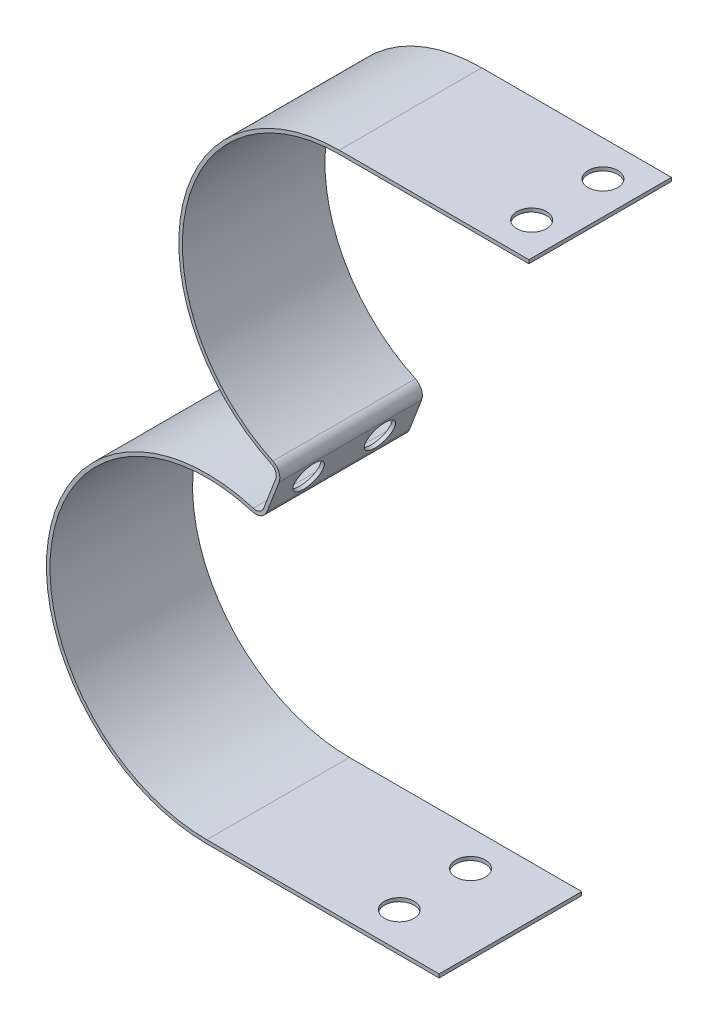
ISO-10303-21;
HEADER;
FILE_DESCRIPTION(('STEP AP214'),'2;1');
FILE_NAME('part.step','',(''),(''),'','','');
FILE_SCHEMA(('AUTOMOTIVE_DESIGN { 1 0 10303 214 1 1 1 1 }'));
ENDSEC;
DATA;
#1=APPLICATION_CONTEXT('core data for automotive mechanical design processes');
#2=APPLICATION_PROTOCOL_DEFINITION('international standard','automotive_design',2000,#1);
#3=PRODUCT_CONTEXT('',#1,'mechanical');
#4=PRODUCT('Part','Part','',(#3));
#5=PRODUCT_RELATED_PRODUCT_CATEGORY('part','',(#4));
#6=PRODUCT_DEFINITION_FORMATION('','',#4);
#7=PRODUCT_DEFINITION_CONTEXT('part definition',#1,'design');
#8=PRODUCT_DEFINITION('design','',#6,#7);
#9=PRODUCT_DEFINITION_SHAPE('','',#8);
#10=(LENGTH_UNIT() NAMED_UNIT(*) SI_UNIT(.MILLI.,.METRE.));
#11=(NAMED_UNIT(*) PLANE_ANGLE_UNIT() SI_UNIT($,.RADIAN.));
#12=(NAMED_UNIT(*) SI_UNIT($,.STERADIAN.) SOLID_ANGLE_UNIT());
#13=UNCERTAINTY_MEASURE_WITH_UNIT(LENGTH_MEASURE(1.E-05),#10,'distance_accuracy_value','');
#14=(GEOMETRIC_REPRESENTATION_CONTEXT(3) GLOBAL_UNCERTAINTY_ASSIGNED_CONTEXT((#13)) GLOBAL_UNIT_ASSIGNED_CONTEXT((#10,
#11,#12)) REPRESENTATION_CONTEXT('',''));
#15=CARTESIAN_POINT('',(0.,0.,0.));
#16=DIRECTION('',(0.,0.,1.));
#17=DIRECTION('',(1.,0.,0.));
#18=AXIS2_PLACEMENT_3D('',#15,#16,#17);
#19=CARTESIAN_POINT('',(0.,0.,31.75));
#20=DIRECTION('',(0.,0.,-1.));
#21=DIRECTION('',(-1.,0.,0.));
#22=AXIS2_PLACEMENT_3D('',#19,#20,#21);
#23=CYLINDRICAL_SURFACE('',#22,35.71875);
#24=CARTESIAN_POINT('',(0.,0.,0.));
#25=DIRECTION('',(0.,0.,1.));
#26=DIRECTION('',(1.,0.,0.));
#27=AXIS2_PLACEMENT_3D('',#24,#25,#26);
#28=CIRCLE('',#27,35.71875);
#29=CARTESIAN_POINT('',(0.,35.71875,0.));
#30=VERTEX_POINT('',#29);
#31=CARTESIAN_POINT('',(-15.1176216798867,-32.3618079888365,0.));
#32=VERTEX_POINT('',#31);
#33=EDGE_CURVE('E247',#30,#32,#28,.T.);
#34=ORIENTED_EDGE('',*,*,#33,.T.);
#35=DIRECTION('',(0.,0.,-1.));
#36=VECTOR('',#35,1.);
#37=CARTESIAN_POINT('',(-15.1176216798867,-32.3618079888365,31.75));
#38=LINE('',#37,#36);
#39=CARTESIAN_POINT('',(-15.1176216798867,-32.3618079888365,31.75));
#40=VERTEX_POINT('',#39);
#41=EDGE_CURVE('E339',#32,#40,#38,.F.);
#42=ORIENTED_EDGE('',*,*,#41,.T.);
#43=CARTESIAN_POINT('',(0.,0.,31.75));
#44=DIRECTION('',(0.,0.,1.));
#45=DIRECTION('',(1.,0.,0.));
#46=AXIS2_PLACEMENT_3D('',#43,#44,#45);
#47=CIRCLE('',#46,35.71875);
#48=CARTESIAN_POINT('',(0.,35.71875,31.75));
#49=VERTEX_POINT('',#48);
#50=EDGE_CURVE('E285',#49,#40,#47,.T.);
#51=ORIENTED_EDGE('',*,*,#50,.F.);
#52=DIRECTION('',(0.,0.,-1.));
#53=VECTOR('',#52,1.);
#54=CARTESIAN_POINT('',(0.,35.71875,31.75));
#55=LINE('',#54,#53);
#56=EDGE_CURVE('E246',#49,#30,#55,.T.);
#57=ORIENTED_EDGE('',*,*,#56,.T.);
#58=EDGE_LOOP('',(#34,#42,#51,#57));
#59=FACE_BOUND('',#58,.T.);
#60=ADVANCED_FACE('F41',(#59),#23,.T.);
#61=CARTESIAN_POINT('',(-17.4708747755268,-43.4671229922889,31.75));
#62=DIRECTION('',(0.934042574676225,-0.357161684244276,0.));
#63=DIRECTION('',(0.357161684244276,0.934042574676226,0.));
#64=AXIS2_PLACEMENT_3D('',#61,#62,#63);
#65=PLANE('',#64);
#66=CARTESIAN_POINT('',(-15.4832448108318,-38.2691101828923,23.8125));
#67=DIRECTION('',(-0.934042574676225,0.357161684244276,0.));
#68=DIRECTION('',(-0.357161684244276,-0.934042574676225,0.));
#69=AXIS2_PLACEMENT_3D('',#66,#67,#68);
#70=CIRCLE('',#69,3.302);
#71=CARTESIAN_POINT('',(-16.6625926922064,-41.3533187644732,23.8125));
#72=VERTEX_POINT('',#71);
#73=EDGE_CURVE('E318',#72,#72,#70,.T.);
#74=ORIENTED_EDGE('',*,*,#73,.F.);
#75=EDGE_LOOP('',(#74));
#76=FACE_BOUND('',#75,.T.);
#77=CARTESIAN_POINT('',(-15.4832448108318,-38.2691101828923,7.9375));
#78=DIRECTION('',(-0.934042574676225,0.357161684244276,0.));
#79=DIRECTION('',(-0.357161684244276,-0.934042574676225,0.));
#80=AXIS2_PLACEMENT_3D('',#77,#78,#79);
#81=CIRCLE('',#80,3.302);
#82=CARTESIAN_POINT('',(-16.6625926922064,-41.3533187644732,7.9375));
#83=VERTEX_POINT('',#82);
#84=EDGE_CURVE('E313',#83,#83,#81,.T.);
#85=ORIENTED_EDGE('',*,*,#84,.F.);
#86=EDGE_LOOP('',(#85));
#87=FACE_BOUND('',#86,.T.);
#88=DIRECTION('',(-0.357161684244276,-0.934042574676225,0.));
#89=VECTOR('',#88,1.);
#90=CARTESIAN_POINT('',(-17.4708747755268,-43.4671229922889,0.));
#91=LINE('',#90,#89);
#92=CARTESIAN_POINT('',(-14.1445437313891,-34.7681640900598,0.));
#93=VERTEX_POINT('',#92);
#94=CARTESIAN_POINT('',(-16.8219458902744,-41.7700562757248,0.));
#95=VERTEX_POINT('',#94);
#96=EDGE_CURVE('E251',#93,#95,#91,.T.);
#97=ORIENTED_EDGE('',*,*,#96,.T.);
#98=DIRECTION('',(0.,0.,1.));
#99=VECTOR('',#98,1.);
#100=CARTESIAN_POINT('',(-16.8219458902744,-41.7700562757248,31.75));
#101=LINE('',#100,#99);
#102=CARTESIAN_POINT('',(-16.8219458902744,-41.7700562757248,31.75));
#103=VERTEX_POINT('',#102);
#104=EDGE_CURVE('E336',#95,#103,#101,.T.);
#105=ORIENTED_EDGE('',*,*,#104,.T.);
#106=DIRECTION('',(-0.357161684244276,-0.934042574676225,0.));
#107=VECTOR('',#106,1.);
#108=CARTESIAN_POINT('',(-17.4708747755268,-43.4671229922889,31.75));
#109=LINE('',#108,#107);
#110=CARTESIAN_POINT('',(-14.1445437313891,-34.7681640900598,31.75));
#111=VERTEX_POINT('',#110);
#112=EDGE_CURVE('E201',#111,#103,#109,.T.);
#113=ORIENTED_EDGE('',*,*,#112,.F.);
#114=DIRECTION('',(0.,0.,1.));
#115=VECTOR('',#114,1.);
#116=CARTESIAN_POINT('',(-14.1445437313891,-34.7681640900598,0.));
#117=LINE('',#116,#115);
#118=EDGE_CURVE('E332',#111,#93,#117,.F.);
#119=ORIENTED_EDGE('',*,*,#118,.T.);
#120=EDGE_LOOP('',(#97,#105,#113,#119));
#121=FACE_BOUND('',#120,.T.);
#122=ADVANCED_FACE('F412',(#76,#87,#121),#65,.F.);
#123=CARTESIAN_POINT('',(-29.483697034365,-77.1052145395224,31.75));
#124=DIRECTION('',(0.,0.,-1.));
#125=DIRECTION('',(-1.,0.,0.));
#126=AXIS2_PLACEMENT_3D('',#123,#124,#125);
#127=CYLINDRICAL_SURFACE('',#126,35.71875);
#128=CARTESIAN_POINT('',(-29.483697034365,-77.1052145395224,31.75));
#129=DIRECTION('',(0.,0.,1.));
#130=DIRECTION('',(1.,0.,0.));
#131=AXIS2_PLACEMENT_3D('',#128,#129,#130);
#132=CIRCLE('',#131,35.71875);
#133=CARTESIAN_POINT('',(-19.1523045919609,-42.9132354835576,31.75));
#134=VERTEX_POINT('',#133);
#135=CARTESIAN_POINT('',(-29.483697034365,-112.823964539522,31.75));
#136=VERTEX_POINT('',#135);
#137=EDGE_CURVE('E188',#134,#136,#132,.T.);
#138=ORIENTED_EDGE('',*,*,#137,.F.);
#139=DIRECTION('',(0.,0.,-1.));
#140=VECTOR('',#139,1.);
#141=CARTESIAN_POINT('',(-19.1523045919609,-42.9132354835576,31.75));
#142=LINE('',#141,#140);
#143=CARTESIAN_POINT('',(-19.1523045919609,-42.9132354835576,0.));
#144=VERTEX_POINT('',#143);
#145=EDGE_CURVE('E211',#134,#144,#142,.T.);
#146=ORIENTED_EDGE('',*,*,#145,.T.);
#147=CARTESIAN_POINT('',(-29.483697034365,-77.1052145395224,0.));
#148=DIRECTION('',(0.,0.,1.));
#149=DIRECTION('',(1.,0.,0.));
#150=AXIS2_PLACEMENT_3D('',#147,#148,#149);
#151=CIRCLE('',#150,35.71875);
#152=CARTESIAN_POINT('',(-29.483697034365,-112.823964539522,0.));
#153=VERTEX_POINT('',#152);
#154=EDGE_CURVE('E207',#144,#153,#151,.T.);
#155=ORIENTED_EDGE('',*,*,#154,.T.);
#156=DIRECTION('',(0.,0.,-1.));
#157=VECTOR('',#156,1.);
#158=CARTESIAN_POINT('',(-29.483697034365,-112.823964539522,31.75));
#159=LINE('',#158,#157);
#160=EDGE_CURVE('E204',#136,#153,#159,.T.);
#161=ORIENTED_EDGE('',*,*,#160,.F.);
#162=EDGE_LOOP('',(#138,#146,#155,#161));
#163=FACE_BOUND('',#162,.T.);
#164=ADVANCED_FACE('F205',(#163),#127,.T.);
#165=CARTESIAN_POINT('',(-29.483697034365,-112.823964539522,31.75));
#166=DIRECTION('',(0.,1.,0.));
#167=DIRECTION('',(-1.,0.,0.));
#168=AXIS2_PLACEMENT_3D('',#165,#166,#167);
#169=PLANE('',#168);
#170=CARTESIAN_POINT('',(5.44130296563498,-112.823964539522,7.9375));
#171=DIRECTION('',(0.,-1.,0.));
#172=DIRECTION('',(1.,0.,0.));
#173=AXIS2_PLACEMENT_3D('',#170,#171,#172);
#174=CIRCLE('',#173,3.302);
#175=CARTESIAN_POINT('',(8.74330296563498,-112.823964539522,7.9375));
#176=VERTEX_POINT('',#175);
#177=EDGE_CURVE('E329',#176,#176,#174,.T.);
#178=ORIENTED_EDGE('',*,*,#177,.F.);
#179=EDGE_LOOP('',(#178));
#180=FACE_BOUND('',#179,.T.);
#181=CARTESIAN_POINT('',(5.44130296563498,-112.823964539522,23.8125));
#182=DIRECTION('',(0.,-1.,0.));
#183=DIRECTION('',(1.,0.,0.));
#184=AXIS2_PLACEMENT_3D('',#181,#182,#183);
#185=CIRCLE('',#184,3.302);
#186=CARTESIAN_POINT('',(8.74330296563498,-112.823964539522,23.8125));
#187=VERTEX_POINT('',#186);
#188=EDGE_CURVE('E324',#187,#187,#185,.T.);
#189=ORIENTED_EDGE('',*,*,#188,.F.);
#190=EDGE_LOOP('',(#189));
#191=FACE_BOUND('',#190,.T.);
#192=DIRECTION('',(1.,0.,0.));
#193=VECTOR('',#192,1.);
#194=CARTESIAN_POINT('',(-29.483697034365,-112.823964539522,0.));
#195=LINE('',#194,#193);
#196=CARTESIAN_POINT('',(22.2580277311512,-112.823964539522,0.));
#197=VERTEX_POINT('',#196);
#198=EDGE_CURVE('E258',#153,#197,#195,.T.);
#199=ORIENTED_EDGE('',*,*,#198,.T.);
#200=DIRECTION('',(0.,0.,-1.));
#201=VECTOR('',#200,1.);
#202=CARTESIAN_POINT('',(22.2580277311512,-112.823964539522,31.75));
#203=LINE('',#202,#201);
#204=CARTESIAN_POINT('',(22.2580277311512,-112.823964539522,31.75));
#205=VERTEX_POINT('',#204);
#206=EDGE_CURVE('E212',#205,#197,#203,.T.);
#207=ORIENTED_EDGE('',*,*,#206,.F.);
#208=DIRECTION('',(1.,0.,0.));
#209=VECTOR('',#208,1.);
#210=CARTESIAN_POINT('',(-29.483697034365,-112.823964539522,31.75));
#211=LINE('',#210,#209);
#212=EDGE_CURVE('E192',#136,#205,#211,.T.);
#213=ORIENTED_EDGE('',*,*,#212,.F.);
#214=ORIENTED_EDGE('',*,*,#160,.T.);
#215=EDGE_LOOP('',(#199,#207,#213,#214));
#216=FACE_BOUND('',#215,.T.);
#217=ADVANCED_FACE('F214',(#180,#191,#216),#169,.F.);
#218=CARTESIAN_POINT('',(22.2580277311512,-112.030214539522,31.75));
#219=DIRECTION('',(-1.,0.,0.));
#220=DIRECTION('',(0.,0.,1.));
#221=AXIS2_PLACEMENT_3D('',#218,#219,#220);
#222=PLANE('',#221);
#223=DIRECTION('',(0.,1.,0.));
#224=VECTOR('',#223,1.);
#225=CARTESIAN_POINT('',(22.2580277311512,-112.030214539522,0.));
#226=LINE('',#225,#224);
#227=CARTESIAN_POINT('',(22.2580277311512,-112.030214539522,0.));
#228=VERTEX_POINT('',#227);
#229=EDGE_CURVE('E261',#197,#228,#226,.T.);
#230=ORIENTED_EDGE('',*,*,#229,.T.);
#231=DIRECTION('',(0.,0.,-1.));
#232=VECTOR('',#231,1.);
#233=CARTESIAN_POINT('',(22.2580277311512,-112.030214539522,31.75));
#234=LINE('',#233,#232);
#235=CARTESIAN_POINT('',(22.2580277311512,-112.030214539522,31.75));
#236=VERTEX_POINT('',#235);
#237=EDGE_CURVE('E305',#236,#228,#234,.T.);
#238=ORIENTED_EDGE('',*,*,#237,.F.);
#239=DIRECTION('',(0.,1.,0.));
#240=VECTOR('',#239,1.);
#241=CARTESIAN_POINT('',(22.2580277311512,-112.030214539522,31.75));
#242=LINE('',#241,#240);
#243=EDGE_CURVE('E218',#205,#236,#242,.T.);
#244=ORIENTED_EDGE('',*,*,#243,.F.);
#245=ORIENTED_EDGE('',*,*,#206,.T.);
#246=EDGE_LOOP('',(#230,#238,#244,#245));
#247=FACE_BOUND('',#246,.T.);
#248=ADVANCED_FACE('F400',(#247),#222,.F.);
#249=CARTESIAN_POINT('',(-29.483697034365,-112.030214539522,31.75));
#250=DIRECTION('',(0.,-1.,0.));
#251=DIRECTION('',(1.,0.,0.));
#252=AXIS2_PLACEMENT_3D('',#249,#250,#251);
#253=PLANE('',#252);
#254=CARTESIAN_POINT('',(5.44130296563498,-112.030214539522,7.9375));
#255=DIRECTION('',(0.,-1.,0.));
#256=DIRECTION('',(1.,0.,0.));
#257=AXIS2_PLACEMENT_3D('',#254,#255,#256);
#258=CIRCLE('',#257,3.302);
#259=CARTESIAN_POINT('',(8.74330296563498,-112.030214539522,7.9375));
#260=VERTEX_POINT('',#259);
#261=EDGE_CURVE('E325',#260,#260,#258,.T.);
#262=ORIENTED_EDGE('',*,*,#261,.T.);
#263=EDGE_LOOP('',(#262));
#264=FACE_BOUND('',#263,.T.);
#265=CARTESIAN_POINT('',(5.44130296563498,-112.030214539522,23.8125));
#266=DIRECTION('',(0.,-1.,0.));
#267=DIRECTION('',(1.,0.,0.));
#268=AXIS2_PLACEMENT_3D('',#265,#266,#267);
#269=CIRCLE('',#268,3.302);
#270=CARTESIAN_POINT('',(8.74330296563498,-112.030214539522,23.8125));
#271=VERTEX_POINT('',#270);
#272=EDGE_CURVE('E319',#271,#271,#269,.T.);
#273=ORIENTED_EDGE('',*,*,#272,.T.);
#274=EDGE_LOOP('',(#273));
#275=FACE_BOUND('',#274,.T.);
#276=DIRECTION('',(-1.,0.,0.));
#277=VECTOR('',#276,1.);
#278=CARTESIAN_POINT('',(-29.483697034365,-112.030214539522,0.));
#279=LINE('',#278,#277);
#280=CARTESIAN_POINT('',(-29.483697034365,-112.030214539522,0.));
#281=VERTEX_POINT('',#280);
#282=EDGE_CURVE('E264',#228,#281,#279,.T.);
#283=ORIENTED_EDGE('',*,*,#282,.T.);
#284=DIRECTION('',(0.,0.,-1.));
#285=VECTOR('',#284,1.);
#286=CARTESIAN_POINT('',(-29.483697034365,-112.030214539522,31.75));
#287=LINE('',#286,#285);
#288=CARTESIAN_POINT('',(-29.483697034365,-112.030214539522,31.75));
#289=VERTEX_POINT('',#288);
#290=EDGE_CURVE('E301',#289,#281,#287,.T.);
#291=ORIENTED_EDGE('',*,*,#290,.F.);
#292=DIRECTION('',(-1.,0.,0.));
#293=VECTOR('',#292,1.);
#294=CARTESIAN_POINT('',(-29.483697034365,-112.030214539522,31.75));
#295=LINE('',#294,#293);
#296=EDGE_CURVE('E222',#236,#289,#295,.T.);
#297=ORIENTED_EDGE('',*,*,#296,.F.);
#298=ORIENTED_EDGE('',*,*,#237,.T.);
#299=EDGE_LOOP('',(#283,#291,#297,#298));
#300=FACE_BOUND('',#299,.T.);
#301=ADVANCED_FACE('F396',(#264,#275,#300),#253,.F.);
#302=CARTESIAN_POINT('',(-29.483697034365,-77.1052145395224,31.75));
#303=DIRECTION('',(0.,0.,-1.));
#304=DIRECTION('',(-1.,0.,0.));
#305=AXIS2_PLACEMENT_3D('',#302,#303,#304);
#306=CYLINDRICAL_SURFACE('',#305,34.925);
#307=CARTESIAN_POINT('',(-29.483697034365,-77.1052145395224,0.));
#308=DIRECTION('',(0.,0.,-1.));
#309=DIRECTION('',(1.,0.,0.));
#310=AXIS2_PLACEMENT_3D('',#307,#308,#309);
#311=CIRCLE('',#310,34.925);
#312=CARTESIAN_POINT('',(-19.381891090681,-43.6730572403568,0.));
#313=VERTEX_POINT('',#312);
#314=EDGE_CURVE('E267',#281,#313,#311,.T.);
#315=ORIENTED_EDGE('',*,*,#314,.T.);
#316=DIRECTION('',(0.,0.,-1.));
#317=VECTOR('',#316,1.);
#318=CARTESIAN_POINT('',(-19.381891090681,-43.6730572403568,31.75));
#319=LINE('',#318,#317);
#320=CARTESIAN_POINT('',(-19.381891090681,-43.6730572403568,31.75));
#321=VERTEX_POINT('',#320);
#322=EDGE_CURVE('E11',#313,#321,#319,.F.);
#323=ORIENTED_EDGE('',*,*,#322,.T.);
#324=CARTESIAN_POINT('',(-29.483697034365,-77.1052145395224,31.75));
#325=DIRECTION('',(0.,0.,-1.));
#326=DIRECTION('',(1.,0.,0.));
#327=AXIS2_PLACEMENT_3D('',#324,#325,#326);
#328=CIRCLE('',#327,34.925);
#329=EDGE_CURVE('E228',#289,#321,#328,.T.);
#330=ORIENTED_EDGE('',*,*,#329,.F.);
#331=ORIENTED_EDGE('',*,*,#290,.T.);
#332=EDGE_LOOP('',(#315,#323,#330,#331));
#333=FACE_BOUND('',#332,.T.);
#334=ADVANCED_FACE('F392',(#333),#306,.F.);
#335=CARTESIAN_POINT('',(-17.0098252121337,-44.4837776189552,31.75));
#336=DIRECTION('',(-0.934042574676225,0.357161684244276,0.));
#337=DIRECTION('',(-0.357161684244276,-0.934042574676225,0.));
#338=AXIS2_PLACEMENT_3D('',#335,#336,#337);
#339=PLANE('',#338);
#340=CARTESIAN_POINT('',(-14.7418485171825,-38.5526072697612,23.8125));
#341=DIRECTION('',(-0.934042574676225,0.357161684244276,0.));
#342=DIRECTION('',(-0.357161684244276,-0.934042574676225,0.));
#343=AXIS2_PLACEMENT_3D('',#340,#341,#342);
#344=CIRCLE('',#343,3.302);
#345=CARTESIAN_POINT('',(-15.9211963985571,-41.6368158513421,23.8125));
#346=VERTEX_POINT('',#345);
#347=EDGE_CURVE('E314',#346,#346,#344,.T.);
#348=ORIENTED_EDGE('',*,*,#347,.T.);
#349=EDGE_LOOP('',(#348));
#350=FACE_BOUND('',#349,.T.);
#351=CARTESIAN_POINT('',(-14.7418485171825,-38.5526072697612,7.9375));
#352=DIRECTION('',(-0.934042574676225,0.357161684244276,0.));
#353=DIRECTION('',(-0.357161684244276,-0.934042574676225,0.));
#354=AXIS2_PLACEMENT_3D('',#351,#352,#353);
#355=CIRCLE('',#354,3.302);
#356=CARTESIAN_POINT('',(-15.9211963985571,-41.6368158513421,7.9375));
#357=VERTEX_POINT('',#356);
#358=EDGE_CURVE('E252',#357,#357,#355,.T.);
#359=ORIENTED_EDGE('',*,*,#358,.T.);
#360=EDGE_LOOP('',(#359));
#361=FACE_BOUND('',#360,.T.);
#362=DIRECTION('',(0.357161684244276,0.934042574676225,0.));
#363=VECTOR('',#362,1.);
#364=CARTESIAN_POINT('',(-17.0098252121337,-44.4837776189552,0.));
#365=LINE('',#364,#363);
#366=CARTESIAN_POINT('',(-16.0805495966252,-42.0535533625937,0.));
#367=VERTEX_POINT('',#366);
#368=CARTESIAN_POINT('',(-13.4031474377398,-35.0516611769287,0.));
#369=VERTEX_POINT('',#368);
#370=EDGE_CURVE('E270',#367,#369,#365,.T.);
#371=ORIENTED_EDGE('',*,*,#370,.T.);
#372=DIRECTION('',(0.,0.,-1.));
#373=VECTOR('',#372,1.);
#374=CARTESIAN_POINT('',(-13.4031474377398,-35.0516611769287,31.75));
#375=LINE('',#374,#373);
#376=CARTESIAN_POINT('',(-13.4031474377398,-35.0516611769287,31.75));
#377=VERTEX_POINT('',#376);
#378=EDGE_CURVE('E69',#369,#377,#375,.F.);
#379=ORIENTED_EDGE('',*,*,#378,.T.);
#380=DIRECTION('',(0.357161684244276,0.934042574676225,0.));
#381=VECTOR('',#380,1.);
#382=CARTESIAN_POINT('',(-17.0098252121337,-44.4837776189552,31.75));
#383=LINE('',#382,#381);
#384=CARTESIAN_POINT('',(-16.0805495966252,-42.0535533625937,31.75));
#385=VERTEX_POINT('',#384);
#386=EDGE_CURVE('E231',#385,#377,#383,.T.);
#387=ORIENTED_EDGE('',*,*,#386,.F.);
#388=DIRECTION('',(0.,0.,-1.));
#389=VECTOR('',#388,1.);
#390=CARTESIAN_POINT('',(-16.0805495966252,-42.0535533625937,31.75));
#391=LINE('',#390,#389);
#392=EDGE_CURVE('E363',#385,#367,#391,.T.);
#393=ORIENTED_EDGE('',*,*,#392,.T.);
#394=EDGE_LOOP('',(#371,#379,#387,#393));
#395=FACE_BOUND('',#394,.T.);
#396=ADVANCED_FACE('F386',(#350,#361,#395),#339,.F.);
#397=CARTESIAN_POINT('',(0.,0.,31.75));
#398=DIRECTION('',(0.,0.,-1.));
#399=DIRECTION('',(-1.,0.,0.));
#400=AXIS2_PLACEMENT_3D('',#397,#398,#399);
#401=CYLINDRICAL_SURFACE('',#400,34.925);
#402=CARTESIAN_POINT('',(0.,0.,31.75));
#403=DIRECTION('',(0.,0.,-1.));
#404=DIRECTION('',(1.,0.,0.));
#405=AXIS2_PLACEMENT_3D('',#402,#403,#404);
#406=CIRCLE('',#405,34.925);
#407=CARTESIAN_POINT('',(-14.7816745314447,-31.6426567001957,31.75));
#408=VERTEX_POINT('',#407);
#409=CARTESIAN_POINT('',(0.,34.925,31.75));
#410=VERTEX_POINT('',#409);
#411=EDGE_CURVE('E234',#408,#410,#406,.T.);
#412=ORIENTED_EDGE('',*,*,#411,.F.);
#413=DIRECTION('',(0.,0.,-1.));
#414=VECTOR('',#413,1.);
#415=CARTESIAN_POINT('',(-14.7816745314447,-31.6426567001957,31.75));
#416=LINE('',#415,#414);
#417=CARTESIAN_POINT('',(-14.7816745314447,-31.6426567001957,0.));
#418=VERTEX_POINT('',#417);
#419=EDGE_CURVE('E353',#408,#418,#416,.T.);
#420=ORIENTED_EDGE('',*,*,#419,.T.);
#421=CARTESIAN_POINT('',(0.,0.,0.));
#422=DIRECTION('',(0.,0.,-1.));
#423=DIRECTION('',(1.,0.,0.));
#424=AXIS2_PLACEMENT_3D('',#421,#422,#423);
#425=CIRCLE('',#424,34.925);
#426=CARTESIAN_POINT('',(0.,34.925,0.));
#427=VERTEX_POINT('',#426);
#428=EDGE_CURVE('E273',#418,#427,#425,.T.);
#429=ORIENTED_EDGE('',*,*,#428,.T.);
#430=DIRECTION('',(0.,0.,-1.));
#431=VECTOR('',#430,1.);
#432=CARTESIAN_POINT('',(0.,34.925,31.75));
#433=LINE('',#432,#431);
#434=EDGE_CURVE('E297',#410,#427,#433,.T.);
#435=ORIENTED_EDGE('',*,*,#434,.F.);
#436=EDGE_LOOP('',(#412,#420,#429,#435));
#437=FACE_BOUND('',#436,.T.);
#438=ADVANCED_FACE('F378',(#437),#401,.F.);
#439=CARTESIAN_POINT('',(0.,34.925,31.75));
#440=DIRECTION('',(0.,1.,0.));
#441=DIRECTION('',(0.,0.,1.));
#442=AXIS2_PLACEMENT_3D('',#439,#440,#441);
#443=PLANE('',#442);
#444=CARTESIAN_POINT('',(34.925,34.925,23.8125));
#445=DIRECTION('',(0.,1.,0.));
#446=DIRECTION('',(0.,0.,1.));
#447=AXIS2_PLACEMENT_3D('',#444,#445,#446);
#448=CIRCLE('',#447,3.302);
#449=CARTESIAN_POINT('',(34.925,34.925,27.1145));
#450=VERTEX_POINT('',#449);
#451=EDGE_CURVE('E663',#450,#450,#448,.T.);
#452=ORIENTED_EDGE('',*,*,#451,.T.);
#453=EDGE_LOOP('',(#452));
#454=FACE_BOUND('',#453,.T.);
#455=CARTESIAN_POINT('',(34.925,34.925,7.9375));
#456=DIRECTION('',(0.,1.,0.));
#457=DIRECTION('',(0.,0.,1.));
#458=AXIS2_PLACEMENT_3D('',#455,#456,#457);
#459=CIRCLE('',#458,3.302);
#460=CARTESIAN_POINT('',(34.925,34.925,11.2395));
#461=VERTEX_POINT('',#460);
#462=EDGE_CURVE('E655',#461,#461,#459,.T.);
#463=ORIENTED_EDGE('',*,*,#462,.T.);
#464=EDGE_LOOP('',(#463));
#465=FACE_BOUND('',#464,.T.);
#466=DIRECTION('',(1.,0.,0.));
#467=VECTOR('',#466,1.);
#468=CARTESIAN_POINT('',(0.,34.925,0.));
#469=LINE('',#468,#467);
#470=CARTESIAN_POINT('',(42.2498801756572,34.925,0.));
#471=VERTEX_POINT('',#470);
#472=EDGE_CURVE('E276',#427,#471,#469,.T.);
#473=ORIENTED_EDGE('',*,*,#472,.T.);
#474=DIRECTION('',(0.,0.,-1.));
#475=VECTOR('',#474,1.);
#476=CARTESIAN_POINT('',(42.2498801756572,34.925,31.75));
#477=LINE('',#476,#475);
#478=CARTESIAN_POINT('',(42.2498801756572,34.925,31.75));
#479=VERTEX_POINT('',#478);
#480=EDGE_CURVE('E293',#479,#471,#477,.T.);
#481=ORIENTED_EDGE('',*,*,#480,.F.);
#482=DIRECTION('',(1.,0.,0.));
#483=VECTOR('',#482,1.);
#484=CARTESIAN_POINT('',(0.,34.925,31.75));
#485=LINE('',#484,#483);
#486=EDGE_CURVE('E237',#410,#479,#485,.T.);
#487=ORIENTED_EDGE('',*,*,#486,.F.);
#488=ORIENTED_EDGE('',*,*,#434,.T.);
#489=EDGE_LOOP('',(#473,#481,#487,#488));
#490=FACE_BOUND('',#489,.T.);
#491=ADVANCED_FACE('F475',(#454,#465,#490),#443,.F.);
#492=CARTESIAN_POINT('',(42.2498801756572,35.71875,31.75));
#493=DIRECTION('',(-1.,0.,0.));
#494=DIRECTION('',(0.,0.,1.));
#495=AXIS2_PLACEMENT_3D('',#492,#493,#494);
#496=PLANE('',#495);
#497=DIRECTION('',(0.,1.,0.));
#498=VECTOR('',#497,1.);
#499=CARTESIAN_POINT('',(42.2498801756572,35.71875,0.));
#500=LINE('',#499,#498);
#501=CARTESIAN_POINT('',(42.2498801756572,35.71875,0.));
#502=VERTEX_POINT('',#501);
#503=EDGE_CURVE('E279',#471,#502,#500,.T.);
#504=ORIENTED_EDGE('',*,*,#503,.T.);
#505=DIRECTION('',(0.,0.,-1.));
#506=VECTOR('',#505,1.);
#507=CARTESIAN_POINT('',(42.2498801756572,35.71875,31.75));
#508=LINE('',#507,#506);
#509=CARTESIAN_POINT('',(42.2498801756572,35.71875,31.75));
#510=VERTEX_POINT('',#509);
#511=EDGE_CURVE('E289',#510,#502,#508,.T.);
#512=ORIENTED_EDGE('',*,*,#511,.F.);
#513=DIRECTION('',(0.,1.,0.));
#514=VECTOR('',#513,1.);
#515=CARTESIAN_POINT('',(42.2498801756572,35.71875,31.75));
#516=LINE('',#515,#514);
#517=EDGE_CURVE('E240',#479,#510,#516,.T.);
#518=ORIENTED_EDGE('',*,*,#517,.F.);
#519=ORIENTED_EDGE('',*,*,#480,.T.);
#520=EDGE_LOOP('',(#504,#512,#518,#519));
#521=FACE_BOUND('',#520,.T.);
#522=ADVANCED_FACE('F479',(#521),#496,.F.);
#523=CARTESIAN_POINT('',(0.,35.71875,31.75));
#524=DIRECTION('',(0.,-1.,0.));
#525=DIRECTION('',(0.,0.,-1.));
#526=AXIS2_PLACEMENT_3D('',#523,#524,#525);
#527=PLANE('',#526);
#528=CARTESIAN_POINT('',(34.925,35.71875,23.8125));
#529=DIRECTION('',(0.,1.,0.));
#530=DIRECTION('',(0.,0.,1.));
#531=AXIS2_PLACEMENT_3D('',#528,#529,#530);
#532=CIRCLE('',#531,3.302);
#533=CARTESIAN_POINT('',(34.925,35.71875,27.1145));
#534=VERTEX_POINT('',#533);
#535=EDGE_CURVE('E323',#534,#534,#532,.T.);
#536=ORIENTED_EDGE('',*,*,#535,.F.);
#537=EDGE_LOOP('',(#536));
#538=FACE_BOUND('',#537,.T.);
#539=CARTESIAN_POINT('',(34.925,35.71875,7.9375));
#540=DIRECTION('',(0.,1.,0.));
#541=DIRECTION('',(0.,0.,1.));
#542=AXIS2_PLACEMENT_3D('',#539,#540,#541);
#543=CIRCLE('',#542,3.302);
#544=CARTESIAN_POINT('',(34.925,35.71875,11.2395));
#545=VERTEX_POINT('',#544);
#546=EDGE_CURVE('E659',#545,#545,#543,.T.);
#547=ORIENTED_EDGE('',*,*,#546,.F.);
#548=EDGE_LOOP('',(#547));
#549=FACE_BOUND('',#548,.T.);
#550=DIRECTION('',(-1.,0.,0.));
#551=VECTOR('',#550,1.);
#552=CARTESIAN_POINT('',(0.,35.71875,0.));
#553=LINE('',#552,#551);
#554=EDGE_CURVE('E282',#502,#30,#553,.T.);
#555=ORIENTED_EDGE('',*,*,#554,.T.);
#556=ORIENTED_EDGE('',*,*,#56,.F.);
#557=DIRECTION('',(-1.,0.,0.));
#558=VECTOR('',#557,1.);
#559=CARTESIAN_POINT('',(0.,35.71875,31.75));
#560=LINE('',#559,#558);
#561=EDGE_CURVE('E243',#510,#49,#560,.T.);
#562=ORIENTED_EDGE('',*,*,#561,.F.);
#563=ORIENTED_EDGE('',*,*,#511,.T.);
#564=EDGE_LOOP('',(#555,#556,#562,#563));
#565=FACE_BOUND('',#564,.T.);
#566=ADVANCED_FACE('F488',(#538,#549,#565),#527,.F.);
#567=CARTESIAN_POINT('',(0.,0.,31.75));
#568=DIRECTION('',(0.,0.,1.));
#569=DIRECTION('',(1.,0.,0.));
#570=AXIS2_PLACEMENT_3D('',#567,#568,#569);
#571=PLANE('',#570);
#572=ORIENTED_EDGE('',*,*,#386,.T.);
#573=CARTESIAN_POINT('',(-15.9238948361473,-34.0877710815744,31.75));
#574=DIRECTION('',(0.,0.,1.));
#575=DIRECTION('',(1.,0.,0.));
#576=AXIS2_PLACEMENT_3D('',#573,#574,#575);
#577=CIRCLE('',#576,2.69875);
#578=EDGE_CURVE('E50',#377,#408,#577,.T.);
#579=ORIENTED_EDGE('',*,*,#578,.T.);
#580=ORIENTED_EDGE('',*,*,#411,.T.);
#581=ORIENTED_EDGE('',*,*,#486,.T.);
#582=ORIENTED_EDGE('',*,*,#517,.T.);
#583=ORIENTED_EDGE('',*,*,#561,.T.);
#584=ORIENTED_EDGE('',*,*,#50,.T.);
#585=CARTESIAN_POINT('',(-15.9238948361473,-34.0877710815744,31.75));
#586=DIRECTION('',(0.,0.,1.));
#587=DIRECTION('',(1.,0.,0.));
#588=AXIS2_PLACEMENT_3D('',#585,#586,#587);
#589=CIRCLE('',#588,1.905);
#590=EDGE_CURVE('E350',#40,#111,#589,.F.);
#591=ORIENTED_EDGE('',*,*,#590,.T.);
#592=ORIENTED_EDGE('',*,*,#112,.T.);
#593=CARTESIAN_POINT('',(-18.6012969950326,-41.0896632672395,31.75));
#594=DIRECTION('',(0.,0.,1.));
#595=DIRECTION('',(1.,0.,0.));
#596=AXIS2_PLACEMENT_3D('',#593,#594,#595);
#597=CIRCLE('',#596,1.905);
#598=EDGE_CURVE('E196',#103,#134,#597,.F.);
#599=ORIENTED_EDGE('',*,*,#598,.T.);
#600=ORIENTED_EDGE('',*,*,#137,.T.);
#601=ORIENTED_EDGE('',*,*,#212,.T.);
#602=ORIENTED_EDGE('',*,*,#243,.T.);
#603=ORIENTED_EDGE('',*,*,#296,.T.);
#604=ORIENTED_EDGE('',*,*,#329,.T.);
#605=CARTESIAN_POINT('',(-18.6012969950327,-41.0896632672395,31.75));
#606=DIRECTION('',(0.,0.,1.));
#607=DIRECTION('',(1.,0.,0.));
#608=AXIS2_PLACEMENT_3D('',#605,#606,#607);
#609=CIRCLE('',#608,2.69875);
#610=EDGE_CURVE('E369',#321,#385,#609,.T.);
#611=ORIENTED_EDGE('',*,*,#610,.T.);
#612=EDGE_LOOP('',(#572,#579,#580,#581,#582,#583,#584,#591,#592,#599,#600,#601,#602,#603,#604,#611));
#613=FACE_BOUND('',#612,.T.);
#614=ADVANCED_FACE('F190',(#613),#571,.T.);
#615=CARTESIAN_POINT('',(0.,0.,0.));
#616=DIRECTION('',(0.,0.,1.));
#617=DIRECTION('',(1.,0.,0.));
#618=AXIS2_PLACEMENT_3D('',#615,#616,#617);
#619=PLANE('',#618);
#620=ORIENTED_EDGE('',*,*,#428,.F.);
#621=CARTESIAN_POINT('',(-15.9238948361473,-34.0877710815744,0.));
#622=DIRECTION('',(0.,0.,1.));
#623=DIRECTION('',(1.,0.,0.));
#624=AXIS2_PLACEMENT_3D('',#621,#622,#623);
#625=CIRCLE('',#624,2.69875);
#626=EDGE_CURVE('E360',#418,#369,#625,.F.);
#627=ORIENTED_EDGE('',*,*,#626,.T.);
#628=ORIENTED_EDGE('',*,*,#370,.F.);
#629=CARTESIAN_POINT('',(-18.6012969950327,-41.0896632672395,0.));
#630=DIRECTION('',(0.,0.,1.));
#631=DIRECTION('',(1.,0.,0.));
#632=AXIS2_PLACEMENT_3D('',#629,#630,#631);
#633=CIRCLE('',#632,2.69875);
#634=EDGE_CURVE('E357',#367,#313,#633,.F.);
#635=ORIENTED_EDGE('',*,*,#634,.T.);
#636=ORIENTED_EDGE('',*,*,#314,.F.);
#637=ORIENTED_EDGE('',*,*,#282,.F.);
#638=ORIENTED_EDGE('',*,*,#229,.F.);
#639=ORIENTED_EDGE('',*,*,#198,.F.);
#640=ORIENTED_EDGE('',*,*,#154,.F.);
#641=CARTESIAN_POINT('',(-18.6012969950326,-41.0896632672395,0.));
#642=DIRECTION('',(0.,0.,1.));
#643=DIRECTION('',(1.,0.,0.));
#644=AXIS2_PLACEMENT_3D('',#641,#642,#643);
#645=CIRCLE('',#644,1.905);
#646=EDGE_CURVE('E342',#144,#95,#645,.T.);
#647=ORIENTED_EDGE('',*,*,#646,.T.);
#648=ORIENTED_EDGE('',*,*,#96,.F.);
#649=CARTESIAN_POINT('',(-15.9238948361473,-34.0877710815744,0.));
#650=DIRECTION('',(0.,0.,1.));
#651=DIRECTION('',(1.,0.,0.));
#652=AXIS2_PLACEMENT_3D('',#649,#650,#651);
#653=CIRCLE('',#652,1.905);
#654=EDGE_CURVE('E347',#93,#32,#653,.T.);
#655=ORIENTED_EDGE('',*,*,#654,.T.);
#656=ORIENTED_EDGE('',*,*,#33,.F.);
#657=ORIENTED_EDGE('',*,*,#554,.F.);
#658=ORIENTED_EDGE('',*,*,#503,.F.);
#659=ORIENTED_EDGE('',*,*,#472,.F.);
#660=EDGE_LOOP('',(#620,#627,#628,#635,#636,#637,#638,#639,#640,#647,#648,#655,#656,#657,#658,#659));
#661=FACE_BOUND('',#660,.T.);
#662=ADVANCED_FACE('F384',(#661),#619,.F.);
#663=CARTESIAN_POINT('',(59.7569987306021,-67.0396746462126,7.9375));
#664=DIRECTION('',(-0.934042574676225,0.357161684244276,0.));
#665=DIRECTION('',(-0.357161684244276,-0.934042574676225,0.));
#666=AXIS2_PLACEMENT_3D('',#663,#664,#665);
#667=CYLINDRICAL_SURFACE('',#666,3.302);
#668=ORIENTED_EDGE('',*,*,#84,.T.);
#669=EDGE_LOOP('',(#668));
#670=FACE_BOUND('',#669,.T.);
#671=ORIENTED_EDGE('',*,*,#358,.F.);
#672=EDGE_LOOP('',(#671));
#673=FACE_BOUND('',#672,.T.);
#674=ADVANCED_FACE('F467',(#670,#673),#667,.F.);
#675=CARTESIAN_POINT('',(59.7569987306021,-67.0396746462126,23.8125));
#676=DIRECTION('',(-0.934042574676225,0.357161684244276,0.));
#677=DIRECTION('',(-0.357161684244276,-0.934042574676225,0.));
#678=AXIS2_PLACEMENT_3D('',#675,#676,#677);
#679=CYLINDRICAL_SURFACE('',#678,3.302);
#680=ORIENTED_EDGE('',*,*,#73,.T.);
#681=EDGE_LOOP('',(#680));
#682=FACE_BOUND('',#681,.T.);
#683=ORIENTED_EDGE('',*,*,#347,.F.);
#684=EDGE_LOOP('',(#683));
#685=FACE_BOUND('',#684,.T.);
#686=ADVANCED_FACE('F555',(#682,#685),#679,.F.);
#687=CARTESIAN_POINT('',(34.925,3.96875,7.9375));
#688=DIRECTION('',(0.,1.,0.));
#689=DIRECTION('',(0.,0.,1.));
#690=AXIS2_PLACEMENT_3D('',#687,#688,#689);
#691=CYLINDRICAL_SURFACE('',#690,3.302);
#692=ORIENTED_EDGE('',*,*,#546,.T.);
#693=EDGE_LOOP('',(#692));
#694=FACE_BOUND('',#693,.T.);
#695=ORIENTED_EDGE('',*,*,#462,.F.);
#696=EDGE_LOOP('',(#695));
#697=FACE_BOUND('',#696,.T.);
#698=ADVANCED_FACE('F547',(#694,#697),#691,.F.);
#699=CARTESIAN_POINT('',(34.925,3.96875,23.8125));
#700=DIRECTION('',(0.,1.,0.));
#701=DIRECTION('',(0.,0.,1.));
#702=AXIS2_PLACEMENT_3D('',#699,#700,#701);
#703=CYLINDRICAL_SURFACE('',#702,3.302);
#704=ORIENTED_EDGE('',*,*,#535,.T.);
#705=EDGE_LOOP('',(#704));
#706=FACE_BOUND('',#705,.T.);
#707=ORIENTED_EDGE('',*,*,#451,.F.);
#708=EDGE_LOOP('',(#707));
#709=FACE_BOUND('',#708,.T.);
#710=ADVANCED_FACE('F539',(#706,#709),#703,.F.);
#711=CARTESIAN_POINT('',(5.44130296563497,-81.0739645395224,23.8125));
#712=DIRECTION('',(0.,-1.,0.));
#713=DIRECTION('',(1.,0.,0.));
#714=AXIS2_PLACEMENT_3D('',#711,#712,#713);
#715=CYLINDRICAL_SURFACE('',#714,3.302);
#716=ORIENTED_EDGE('',*,*,#188,.T.);
#717=EDGE_LOOP('',(#716));
#718=FACE_BOUND('',#717,.T.);
#719=ORIENTED_EDGE('',*,*,#272,.F.);
#720=EDGE_LOOP('',(#719));
#721=FACE_BOUND('',#720,.T.);
#722=ADVANCED_FACE('F531',(#718,#721),#715,.F.);
#723=CARTESIAN_POINT('',(5.44130296563497,-81.0739645395224,7.9375));
#724=DIRECTION('',(0.,-1.,0.));
#725=DIRECTION('',(1.,0.,0.));
#726=AXIS2_PLACEMENT_3D('',#723,#724,#725);
#727=CYLINDRICAL_SURFACE('',#726,3.302);
#728=ORIENTED_EDGE('',*,*,#177,.T.);
#729=EDGE_LOOP('',(#728));
#730=FACE_BOUND('',#729,.T.);
#731=ORIENTED_EDGE('',*,*,#261,.F.);
#732=EDGE_LOOP('',(#731));
#733=FACE_BOUND('',#732,.T.);
#734=ADVANCED_FACE('F426',(#730,#733),#727,.F.);
#735=CARTESIAN_POINT('',(-18.6012969950326,-41.0896632672395,31.75));
#736=DIRECTION('',(0.,0.,-1.));
#737=DIRECTION('',(-1.,0.,0.));
#738=AXIS2_PLACEMENT_3D('',#735,#736,#737);
#739=CYLINDRICAL_SURFACE('',#738,1.905);
#740=ORIENTED_EDGE('',*,*,#598,.F.);
#741=ORIENTED_EDGE('',*,*,#104,.F.);
#742=ORIENTED_EDGE('',*,*,#646,.F.);
#743=ORIENTED_EDGE('',*,*,#145,.F.);
#744=EDGE_LOOP('',(#740,#741,#742,#743));
#745=FACE_BOUND('',#744,.T.);
#746=ADVANCED_FACE('F422',(#745),#739,.F.);
#747=CARTESIAN_POINT('',(-15.9238948361473,-34.0877710815744,31.75));
#748=DIRECTION('',(0.,0.,-1.));
#749=DIRECTION('',(-1.,0.,0.));
#750=AXIS2_PLACEMENT_3D('',#747,#748,#749);
#751=CYLINDRICAL_SURFACE('',#750,1.905);
#752=ORIENTED_EDGE('',*,*,#590,.F.);
#753=ORIENTED_EDGE('',*,*,#41,.F.);
#754=ORIENTED_EDGE('',*,*,#654,.F.);
#755=ORIENTED_EDGE('',*,*,#118,.F.);
#756=EDGE_LOOP('',(#752,#753,#754,#755));
#757=FACE_BOUND('',#756,.T.);
#758=ADVANCED_FACE('F425',(#757),#751,.F.);
#759=CARTESIAN_POINT('',(-15.9238948361473,-34.0877710815744,31.75));
#760=DIRECTION('',(0.,0.,-1.));
#761=DIRECTION('',(-1.,0.,0.));
#762=AXIS2_PLACEMENT_3D('',#759,#760,#761);
#763=CYLINDRICAL_SURFACE('',#762,2.69875);
#764=ORIENTED_EDGE('',*,*,#578,.F.);
#765=ORIENTED_EDGE('',*,*,#378,.F.);
#766=ORIENTED_EDGE('',*,*,#626,.F.);
#767=ORIENTED_EDGE('',*,*,#419,.F.);
#768=EDGE_LOOP('',(#764,#765,#766,#767));
#769=FACE_BOUND('',#768,.T.);
#770=ADVANCED_FACE('F381',(#769),#763,.T.);
#771=CARTESIAN_POINT('',(-18.6012969950327,-41.0896632672395,31.75));
#772=DIRECTION('',(0.,0.,-1.));
#773=DIRECTION('',(-1.,0.,0.));
#774=AXIS2_PLACEMENT_3D('',#771,#772,#773);
#775=CYLINDRICAL_SURFACE('',#774,2.69875);
#776=ORIENTED_EDGE('',*,*,#610,.F.);
#777=ORIENTED_EDGE('',*,*,#322,.F.);
#778=ORIENTED_EDGE('',*,*,#634,.F.);
#779=ORIENTED_EDGE('',*,*,#392,.F.);
#780=EDGE_LOOP('',(#776,#777,#778,#779));
#781=FACE_BOUND('',#780,.T.);
#782=ADVANCED_FACE('F43',(#781),#775,.T.);
#783=CLOSED_SHELL('',(#60,#122,#164,#217,#248,#301,#334,#396,#438,#491,#522,#566,#614,#662,#674,
#686,#698,#710,#722,#734,#746,#758,#770,#782));
#784=MANIFOLD_SOLID_BREP('B2',#783);
#785=ADVANCED_BREP_SHAPE_REPRESENTATION('',(#18,#784),#14);
#786=SHAPE_DEFINITION_REPRESENTATION(#9,#785);
ENDSEC;
END-ISO-10303-21;
